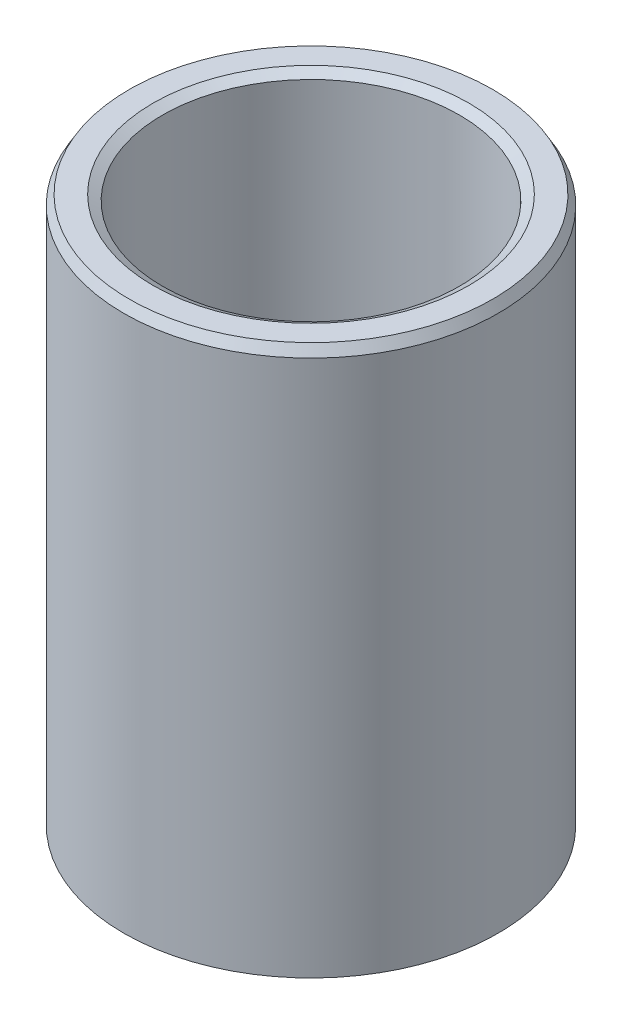
ISO-10303-21;
HEADER;
FILE_DESCRIPTION(('STEP AP214'),'2;1');
FILE_NAME('part.step','',(''),(''),'','','');
FILE_SCHEMA(('AUTOMOTIVE_DESIGN { 1 0 10303 214 1 1 1 1 }'));
ENDSEC;
DATA;
#1=APPLICATION_CONTEXT('core data for automotive mechanical design processes');
#2=APPLICATION_PROTOCOL_DEFINITION('international standard','automotive_design',2000,#1);
#3=PRODUCT_CONTEXT('',#1,'mechanical');
#4=PRODUCT('Part','Part','',(#3));
#5=PRODUCT_RELATED_PRODUCT_CATEGORY('part','',(#4));
#6=PRODUCT_DEFINITION_FORMATION('','',#4);
#7=PRODUCT_DEFINITION_CONTEXT('part definition',#1,'design');
#8=PRODUCT_DEFINITION('design','',#6,#7);
#9=PRODUCT_DEFINITION_SHAPE('','',#8);
#10=(LENGTH_UNIT() NAMED_UNIT(*) SI_UNIT(.MILLI.,.METRE.));
#11=(NAMED_UNIT(*) PLANE_ANGLE_UNIT() SI_UNIT($,.RADIAN.));
#12=(NAMED_UNIT(*) SI_UNIT($,.STERADIAN.) SOLID_ANGLE_UNIT());
#13=UNCERTAINTY_MEASURE_WITH_UNIT(LENGTH_MEASURE(1.E-05),#10,'distance_accuracy_value','');
#14=(GEOMETRIC_REPRESENTATION_CONTEXT(3) GLOBAL_UNCERTAINTY_ASSIGNED_CONTEXT((#13)) GLOBAL_UNIT_ASSIGNED_CONTEXT((#10,
#11,#12)) REPRESENTATION_CONTEXT('',''));
#15=CARTESIAN_POINT('',(0.,0.,0.));
#16=DIRECTION('',(0.,0.,1.));
#17=DIRECTION('',(1.,0.,0.));
#18=AXIS2_PLACEMENT_3D('',#15,#16,#17);
#19=CARTESIAN_POINT('',(0.,81.067047695199,0.));
#20=DIRECTION('',(0.,-1.,0.));
#21=DIRECTION('',(0.,0.,-1.));
#22=AXIS2_PLACEMENT_3D('',#19,#20,#21);
#23=CYLINDRICAL_SURFACE('',#22,27.5);
#24=CARTESIAN_POINT('',(0.,0.808685771709672,0.));
#25=DIRECTION('',(0.,1.,0.));
#26=DIRECTION('',(0.,0.,1.));
#27=AXIS2_PLACEMENT_3D('',#24,#25,#26);
#28=CIRCLE('',#27,27.5);
#29=CARTESIAN_POINT('',(0.,0.808685771709658,-27.5));
#30=VERTEX_POINT('',#29);
#31=EDGE_CURVE('E10',#30,#30,#28,.T.);
#32=CARTESIAN_POINT('',(0.,79.6663628512399,0.));
#33=DIRECTION('',(0.,1.,0.));
#34=DIRECTION('',(0.,0.,1.));
#35=AXIS2_PLACEMENT_3D('',#32,#33,#34);
#36=CIRCLE('',#35,27.5);
#37=CARTESIAN_POINT('',(0.,79.6663628512399,-27.5));
#38=VERTEX_POINT('',#37);
#39=EDGE_CURVE('E50',#38,#38,#36,.F.);
#40=CARTESIAN_POINT('',(0.,0.808685771709658,-27.5));
#41=CARTESIAN_POINT('',(0.,1.63011990795477,-27.5));
#42=CARTESIAN_POINT('',(0.,2.45155404419987,-27.5));
#43=CARTESIAN_POINT('',(0.,4.09442231669009,-27.5));
#44=CARTESIAN_POINT('',(0.,4.91585645293519,-27.5));
#45=CARTESIAN_POINT('',(0.,6.5587247254254,-27.5));
#46=CARTESIAN_POINT('',(0.,7.38015886167051,-27.5));
#47=CARTESIAN_POINT('',(0.,9.02302713416073,-27.5));
#48=CARTESIAN_POINT('',(0.,9.84446127040584,-27.5));
#49=CARTESIAN_POINT('',(0.,11.487329542896,-27.5));
#50=CARTESIAN_POINT('',(0.,12.3087636791412,-27.5));
#51=CARTESIAN_POINT('',(0.,13.9516319516314,-27.5));
#52=CARTESIAN_POINT('',(0.,14.7730660878765,-27.5));
#53=CARTESIAN_POINT('',(0.,16.4159343603667,-27.5));
#54=CARTESIAN_POINT('',(0.,17.2373684966118,-27.5));
#55=CARTESIAN_POINT('',(0.,18.880236769102,-27.5));
#56=CARTESIAN_POINT('',(0.,19.7016709053471,-27.5));
#57=CARTESIAN_POINT('',(0.,21.3445391778373,-27.5));
#58=CARTESIAN_POINT('',(0.,22.1659733140824,-27.5));
#59=CARTESIAN_POINT('',(0.,23.8088415865726,-27.5));
#60=CARTESIAN_POINT('',(0.,24.6302757228177,-27.5));
#61=CARTESIAN_POINT('',(0.,26.273143995308,-27.5));
#62=CARTESIAN_POINT('',(0.,27.0945781315531,-27.5));
#63=CARTESIAN_POINT('',(0.,28.7374464040433,-27.5));
#64=CARTESIAN_POINT('',(0.,29.5588805402884,-27.5));
#65=CARTESIAN_POINT('',(0.,31.2017488127786,-27.5));
#66=CARTESIAN_POINT('',(0.,32.0231829490237,-27.5));
#67=CARTESIAN_POINT('',(0.,33.6660512215139,-27.5));
#68=CARTESIAN_POINT('',(0.,34.487485357759,-27.5));
#69=CARTESIAN_POINT('',(0.,36.1303536302492,-27.5));
#70=CARTESIAN_POINT('',(0.,36.9517877664943,-27.5));
#71=CARTESIAN_POINT('',(0.,38.5946560389846,-27.5));
#72=CARTESIAN_POINT('',(0.,39.4160901752297,-27.5));
#73=CARTESIAN_POINT('',(0.,41.0589584477199,-27.5));
#74=CARTESIAN_POINT('',(0.,41.880392583965,-27.5));
#75=CARTESIAN_POINT('',(0.,43.5232608564552,-27.5));
#76=CARTESIAN_POINT('',(0.,44.3446949927003,-27.5));
#77=CARTESIAN_POINT('',(0.,45.9875632651905,-27.5));
#78=CARTESIAN_POINT('',(0.,46.8089974014356,-27.5));
#79=CARTESIAN_POINT('',(0.,48.4518656739258,-27.5));
#80=CARTESIAN_POINT('',(0.,49.2732998101709,-27.5));
#81=CARTESIAN_POINT('',(0.,50.9161680826612,-27.5));
#82=CARTESIAN_POINT('',(0.,51.7376022189063,-27.5));
#83=CARTESIAN_POINT('',(0.,53.3804704913965,-27.5));
#84=CARTESIAN_POINT('',(0.,54.2019046276416,-27.5));
#85=CARTESIAN_POINT('',(0.,55.8447729001318,-27.5));
#86=CARTESIAN_POINT('',(0.,56.6662070363769,-27.5));
#87=CARTESIAN_POINT('',(0.,58.3090753088671,-27.5));
#88=CARTESIAN_POINT('',(0.,59.1305094451122,-27.5));
#89=CARTESIAN_POINT('',(0.,60.7733777176024,-27.5));
#90=CARTESIAN_POINT('',(0.,61.5948118538475,-27.5));
#91=CARTESIAN_POINT('',(0.,63.2376801263378,-27.5));
#92=CARTESIAN_POINT('',(0.,64.0591142625829,-27.5));
#93=CARTESIAN_POINT('',(0.,65.7019825350731,-27.5));
#94=CARTESIAN_POINT('',(0.,66.5234166713182,-27.5));
#95=CARTESIAN_POINT('',(0.,68.1662849438084,-27.5));
#96=CARTESIAN_POINT('',(0.,68.9877190800535,-27.5));
#97=CARTESIAN_POINT('',(0.,70.6305873525437,-27.5));
#98=CARTESIAN_POINT('',(0.,71.4520214887888,-27.5));
#99=CARTESIAN_POINT('',(0.,73.094889761279,-27.5));
#100=CARTESIAN_POINT('',(0.,73.9163238975242,-27.5));
#101=CARTESIAN_POINT('',(0.,75.5591921700144,-27.5));
#102=CARTESIAN_POINT('',(0.,76.3806263062595,-27.5));
#103=CARTESIAN_POINT('',(0.,78.0234945787497,-27.5));
#104=CARTESIAN_POINT('',(0.,78.8449287149948,-27.5));
#105=CARTESIAN_POINT('',(0.,79.6663628512399,-27.5));
#106=B_SPLINE_CURVE_WITH_KNOTS('',3,(#40,#41,#42,#43,#44,#45,#46,#47,#48,#49,#50,#51,#52,#53,
#54,#55,#56,#57,#58,#59,#60,#61,#62,#63,#64,#65,#66,#67,#68,#69,#70,#71,#72,#73,#74,#75,#76,#77,
#78,#79,#80,#81,#82,#83,#84,#85,#86,#87,#88,#89,#90,#91,#92,#93,#94,#95,#96,#97,#98,#99,#100,
#101,#102,#103,#104,#105),.UNSPECIFIED.,.F.,.F.,(4,2,2,2,2,2,2,2,2,2,2,2,2,2,2,2,2,2,2,2,2,2,2,
2,2,2,2,2,2,2,2,2,4),(0.,2.46430240873532,4.92860481747064,7.39290722620596,9.85720963494129,
12.3215120436766,14.7858144524119,17.2501168611472,19.7144192698826,22.1787216786179,
24.6430240873532,27.1073264960885,29.5716289048238,32.0359313135592,34.5002337222945,
36.9645361310298,39.4288385397651,41.8931409485004,44.3574433572358,46.8217457659711,
49.2860481747064,51.7503505834417,54.214652992177,56.6789554009124,59.1432578096477,
61.607560218383,64.0718626271183,66.5361650358536,69.0004674445889,71.4647698533243,
73.9290722620596,76.3933746707949,78.8576770795302),.UNSPECIFIED.);
#107=EDGE_CURVE('BSEAM39',#30,#38,#106,.T.);
#108=ORIENTED_EDGE('',*,*,#31,.T.);
#109=ORIENTED_EDGE('',*,*,#39,.T.);
#110=ORIENTED_EDGE('',*,*,#107,.T.);
#111=ORIENTED_EDGE('',*,*,#107,.F.);
#112=EDGE_LOOP('',(#108,#110,#109,#111));
#113=FACE_BOUND('',#112,.T.);
#114=ADVANCED_FACE('F39',(#113),#23,.T.);
#115=CARTESIAN_POINT('',(0.,81.067047695199,0.));
#116=DIRECTION('',(0.,1.,0.));
#117=DIRECTION('',(0.,0.,1.));
#118=AXIS2_PLACEMENT_3D('',#115,#116,#117);
#119=PLANE('',#118);
#120=CARTESIAN_POINT('',(0.,81.067047695199,0.));
#121=DIRECTION('',(0.,1.,0.));
#122=DIRECTION('',(0.,0.,1.));
#123=AXIS2_PLACEMENT_3D('',#120,#121,#122);
#124=CIRCLE('',#123,23.2023040256056);
#125=CARTESIAN_POINT('',(0.,81.067047695199,23.2023040256056));
#126=VERTEX_POINT('',#125);
#127=EDGE_CURVE('E58',#126,#126,#124,.F.);
#128=ORIENTED_EDGE('',*,*,#127,.T.);
#129=EDGE_LOOP('',(#128));
#130=FACE_BOUND('',#129,.T.);
#131=CARTESIAN_POINT('',(0.,81.067047695199,0.));
#132=DIRECTION('',(0.,1.,0.));
#133=DIRECTION('',(0.,0.,1.));
#134=AXIS2_PLACEMENT_3D('',#131,#132,#133);
#135=CIRCLE('',#134,26.6913142282904);
#136=CARTESIAN_POINT('',(0.,81.067047695199,-26.6913142282904));
#137=VERTEX_POINT('',#136);
#138=EDGE_CURVE('E61',#137,#137,#135,.T.);
#139=ORIENTED_EDGE('',*,*,#138,.T.);
#140=EDGE_LOOP('',(#139));
#141=FACE_BOUND('',#140,.T.);
#142=ADVANCED_FACE('F88',(#130,#141),#119,.T.);
#143=CARTESIAN_POINT('',(0.,0.,0.));
#144=DIRECTION('',(0.,1.,0.));
#145=DIRECTION('',(0.,0.,1.));
#146=AXIS2_PLACEMENT_3D('',#143,#144,#145);
#147=PLANE('',#146);
#148=CARTESIAN_POINT('',(0.,0.,0.));
#149=DIRECTION('',(0.,1.,0.));
#150=DIRECTION('',(0.,0.,1.));
#151=AXIS2_PLACEMENT_3D('',#148,#149,#150);
#152=CIRCLE('',#151,22.610304953356);
#153=CARTESIAN_POINT('',(0.,0.,22.610304953356));
#154=VERTEX_POINT('',#153);
#155=EDGE_CURVE('E51',#154,#154,#152,.T.);
#156=ORIENTED_EDGE('',*,*,#155,.T.);
#157=EDGE_LOOP('',(#156));
#158=FACE_BOUND('',#157,.T.);
#159=CARTESIAN_POINT('',(0.,0.,0.));
#160=DIRECTION('',(0.,1.,0.));
#161=DIRECTION('',(0.,0.,1.));
#162=AXIS2_PLACEMENT_3D('',#159,#160,#161);
#163=CIRCLE('',#162,26.0993151560408);
#164=CARTESIAN_POINT('',(0.,0.,26.0993151560408));
#165=VERTEX_POINT('',#164);
#166=EDGE_CURVE('E54',#165,#165,#163,.F.);
#167=ORIENTED_EDGE('',*,*,#166,.T.);
#168=EDGE_LOOP('',(#167));
#169=FACE_BOUND('',#168,.T.);
#170=ADVANCED_FACE('F83',(#158,#169),#147,.F.);
#171=CARTESIAN_POINT('',(0.,81.067047695199,0.));
#172=DIRECTION('',(0.,-1.,0.));
#173=DIRECTION('',(0.,0.,-1.));
#174=AXIS2_PLACEMENT_3D('',#171,#172,#173);
#175=CYLINDRICAL_SURFACE('',#174,21.8016191816464);
#176=CARTESIAN_POINT('',(0.,80.2583619234893,0.));
#177=DIRECTION('',(0.,1.,0.));
#178=DIRECTION('',(0.,0.,1.));
#179=AXIS2_PLACEMENT_3D('',#176,#177,#178);
#180=CIRCLE('',#179,21.8016191816464);
#181=CARTESIAN_POINT('',(0.,80.2583619234893,-21.8016191816464));
#182=VERTEX_POINT('',#181);
#183=EDGE_CURVE('E67',#182,#182,#180,.T.);
#184=CARTESIAN_POINT('',(0.,1.40068484395911,0.));
#185=DIRECTION('',(0.,1.,0.));
#186=DIRECTION('',(0.,0.,1.));
#187=AXIS2_PLACEMENT_3D('',#184,#185,#186);
#188=CIRCLE('',#187,21.8016191816464);
#189=CARTESIAN_POINT('',(0.,1.4006848439591,-21.8016191816464));
#190=VERTEX_POINT('',#189);
#191=EDGE_CURVE('E69',#190,#190,#188,.F.);
#192=CARTESIAN_POINT('',(0.,80.2583619234893,-21.8016191816464));
#193=CARTESIAN_POINT('',(0.,79.4369277872442,-21.8016191816464));
#194=CARTESIAN_POINT('',(0.,78.6154936509991,-21.8016191816464));
#195=CARTESIAN_POINT('',(0.,76.9726253785089,-21.8016191816464));
#196=CARTESIAN_POINT('',(0.,76.1511912422638,-21.8016191816464));
#197=CARTESIAN_POINT('',(0.,74.5083229697735,-21.8016191816464));
#198=CARTESIAN_POINT('',(0.,73.6868888335284,-21.8016191816464));
#199=CARTESIAN_POINT('',(0.,72.0440205610382,-21.8016191816464));
#200=CARTESIAN_POINT('',(0.,71.2225864247931,-21.8016191816464));
#201=CARTESIAN_POINT('',(0.,69.5797181523029,-21.8016191816464));
#202=CARTESIAN_POINT('',(0.,68.7582840160578,-21.8016191816464));
#203=CARTESIAN_POINT('',(0.,67.1154157435676,-21.8016191816464));
#204=CARTESIAN_POINT('',(0.,66.2939816073225,-21.8016191816464));
#205=CARTESIAN_POINT('',(0.,64.6511133348323,-21.8016191816464));
#206=CARTESIAN_POINT('',(0.,63.8296791985872,-21.8016191816464));
#207=CARTESIAN_POINT('',(0.,62.186810926097,-21.8016191816464));
#208=CARTESIAN_POINT('',(0.,61.3653767898519,-21.8016191816464));
#209=CARTESIAN_POINT('',(0.,59.7225085173616,-21.8016191816464));
#210=CARTESIAN_POINT('',(0.,58.9010743811165,-21.8016191816464));
#211=CARTESIAN_POINT('',(0.,57.2582061086263,-21.8016191816464));
#212=CARTESIAN_POINT('',(0.,56.4367719723812,-21.8016191816464));
#213=CARTESIAN_POINT('',(0.,54.793903699891,-21.8016191816464));
#214=CARTESIAN_POINT('',(0.,53.9724695636459,-21.8016191816464));
#215=CARTESIAN_POINT('',(0.,52.3296012911557,-21.8016191816464));
#216=CARTESIAN_POINT('',(0.,51.5081671549106,-21.8016191816464));
#217=CARTESIAN_POINT('',(0.,49.8652988824204,-21.8016191816464));
#218=CARTESIAN_POINT('',(0.,49.0438647461753,-21.8016191816464));
#219=CARTESIAN_POINT('',(0.,47.400996473685,-21.8016191816464));
#220=CARTESIAN_POINT('',(0.,46.5795623374399,-21.8016191816464));
#221=CARTESIAN_POINT('',(0.,44.9366940649497,-21.8016191816464));
#222=CARTESIAN_POINT('',(0.,44.1152599287046,-21.8016191816464));
#223=CARTESIAN_POINT('',(0.,42.4723916562144,-21.8016191816464));
#224=CARTESIAN_POINT('',(0.,41.6509575199693,-21.8016191816464));
#225=CARTESIAN_POINT('',(0.,40.0080892474791,-21.8016191816464));
#226=CARTESIAN_POINT('',(0.,39.186655111234,-21.8016191816464));
#227=CARTESIAN_POINT('',(0.,37.5437868387438,-21.8016191816464));
#228=CARTESIAN_POINT('',(0.,36.7223527024987,-21.8016191816464));
#229=CARTESIAN_POINT('',(0.,35.0794844300085,-21.8016191816464));
#230=CARTESIAN_POINT('',(0.,34.2580502937634,-21.8016191816464));
#231=CARTESIAN_POINT('',(0.,32.6151820212731,-21.8016191816464));
#232=CARTESIAN_POINT('',(0.,31.793747885028,-21.8016191816464));
#233=CARTESIAN_POINT('',(0.,30.1508796125378,-21.8016191816464));
#234=CARTESIAN_POINT('',(0.,29.3294454762927,-21.8016191816464));
#235=CARTESIAN_POINT('',(0.,27.6865772038025,-21.8016191816464));
#236=CARTESIAN_POINT('',(0.,26.8651430675574,-21.8016191816464));
#237=CARTESIAN_POINT('',(0.,25.2222747950672,-21.8016191816464));
#238=CARTESIAN_POINT('',(0.,24.4008406588221,-21.8016191816464));
#239=CARTESIAN_POINT('',(0.,22.7579723863319,-21.8016191816464));
#240=CARTESIAN_POINT('',(0.,21.9365382500868,-21.8016191816464));
#241=CARTESIAN_POINT('',(0.,20.2936699775965,-21.8016191816464));
#242=CARTESIAN_POINT('',(0.,19.4722358413514,-21.8016191816464));
#243=CARTESIAN_POINT('',(0.,17.8293675688612,-21.8016191816464));
#244=CARTESIAN_POINT('',(0.,17.0079334326161,-21.8016191816464));
#245=CARTESIAN_POINT('',(0.,15.3650651601259,-21.8016191816464));
#246=CARTESIAN_POINT('',(0.,14.5436310238808,-21.8016191816464));
#247=CARTESIAN_POINT('',(0.,12.9007627513906,-21.8016191816464));
#248=CARTESIAN_POINT('',(0.,12.0793286151455,-21.8016191816464));
#249=CARTESIAN_POINT('',(0.,10.4364603426553,-21.8016191816464));
#250=CARTESIAN_POINT('',(0.,9.61502620641017,-21.8016191816464));
#251=CARTESIAN_POINT('',(0.,7.97215793391996,-21.8016191816464));
#252=CARTESIAN_POINT('',(0.,7.15072379767485,-21.8016191816464));
#253=CARTESIAN_POINT('',(0.,5.50785552518464,-21.8016191816464));
#254=CARTESIAN_POINT('',(0.,4.68642138893953,-21.8016191816464));
#255=CARTESIAN_POINT('',(0.,3.04355311644931,-21.8016191816464));
#256=CARTESIAN_POINT('',(0.,2.2221189802042,-21.8016191816464));
#257=CARTESIAN_POINT('',(0.,1.4006848439591,-21.8016191816464));
#258=B_SPLINE_CURVE_WITH_KNOTS('',3,(#192,#193,#194,#195,#196,#197,#198,#199,#200,#201,#202,
#203,#204,#205,#206,#207,#208,#209,#210,#211,#212,#213,#214,#215,#216,#217,#218,#219,#220,#221,
#222,#223,#224,#225,#226,#227,#228,#229,#230,#231,#232,#233,#234,#235,#236,#237,#238,#239,#240,
#241,#242,#243,#244,#245,#246,#247,#248,#249,#250,#251,#252,#253,#254,#255,#256,#257),
.UNSPECIFIED.,.F.,.F.,(4,2,2,2,2,2,2,2,2,2,2,2,2,2,2,2,2,2,2,2,2,2,2,2,2,2,2,2,2,2,2,2,4),(0.,
2.46430240873532,4.92860481747065,7.39290722620596,9.85720963494129,12.3215120436766,
14.7858144524119,17.2501168611472,19.7144192698826,22.1787216786179,24.6430240873532,
27.1073264960885,29.5716289048238,32.0359313135591,34.5002337222945,36.9645361310298,
39.4288385397651,41.8931409485004,44.3574433572357,46.8217457659711,49.2860481747064,
51.7503505834417,54.214652992177,56.6789554009123,59.1432578096477,61.607560218383,
64.0718626271183,66.5361650358536,69.0004674445889,71.4647698533242,73.9290722620595,
76.3933746707949,78.8576770795302),.UNSPECIFIED.);
#259=EDGE_CURVE('BSEAM71',#182,#190,#258,.T.);
#260=ORIENTED_EDGE('',*,*,#183,.T.);
#261=ORIENTED_EDGE('',*,*,#191,.T.);
#262=ORIENTED_EDGE('',*,*,#259,.T.);
#263=ORIENTED_EDGE('',*,*,#259,.F.);
#264=EDGE_LOOP('',(#260,#262,#261,#263));
#265=FACE_BOUND('',#264,.T.);
#266=ADVANCED_FACE('F71',(#265),#175,.F.);
#267=CARTESIAN_POINT('',(0.,80.2583619234893,0.));
#268=DIRECTION('',(0.,1.,0.));
#269=DIRECTION('',(0.,0.,1.));
#270=AXIS2_PLACEMENT_3D('',#267,#268,#269);
#271=CONICAL_SURFACE('',#270,21.8016191816464,1.0471975511966);
#272=ORIENTED_EDGE('',*,*,#127,.F.);
#273=EDGE_LOOP('',(#272));
#274=FACE_BOUND('',#273,.T.);
#275=ORIENTED_EDGE('',*,*,#183,.F.);
#276=EDGE_LOOP('',(#275));
#277=FACE_BOUND('',#276,.T.);
#278=ADVANCED_FACE('F77',(#274,#277),#271,.F.);
#279=CARTESIAN_POINT('',(0.,0.,0.));
#280=DIRECTION('',(0.,-1.,0.));
#281=DIRECTION('',(0.,0.,-1.));
#282=AXIS2_PLACEMENT_3D('',#279,#280,#281);
#283=CONICAL_SURFACE('',#282,22.610304953356,0.523598775598291);
#284=ORIENTED_EDGE('',*,*,#191,.F.);
#285=EDGE_LOOP('',(#284));
#286=FACE_BOUND('',#285,.T.);
#287=ORIENTED_EDGE('',*,*,#155,.F.);
#288=EDGE_LOOP('',(#287));
#289=FACE_BOUND('',#288,.T.);
#290=ADVANCED_FACE('F73',(#286,#289),#283,.F.);
#291=CARTESIAN_POINT('',(0.,0.808685771709672,0.));
#292=DIRECTION('',(0.,1.,0.));
#293=DIRECTION('',(0.,0.,1.));
#294=AXIS2_PLACEMENT_3D('',#291,#292,#293);
#295=CONICAL_SURFACE('',#294,27.5,1.0471975511966);
#296=ORIENTED_EDGE('',*,*,#166,.F.);
#297=EDGE_LOOP('',(#296));
#298=FACE_BOUND('',#297,.T.);
#299=ORIENTED_EDGE('',*,*,#31,.F.);
#300=EDGE_LOOP('',(#299));
#301=FACE_BOUND('',#300,.T.);
#302=ADVANCED_FACE('F76',(#298,#301),#295,.T.);
#303=CARTESIAN_POINT('',(0.,81.067047695199,0.));
#304=DIRECTION('',(0.,-1.,0.));
#305=DIRECTION('',(0.,0.,-1.));
#306=AXIS2_PLACEMENT_3D('',#303,#304,#305);
#307=CONICAL_SURFACE('',#306,26.6913142282904,0.523598775598302);
#308=CARTESIAN_POINT('',(0.,79.6663628512399,-27.5));
#309=CARTESIAN_POINT('',(0.,79.6809533183645,-27.491576189878));
#310=CARTESIAN_POINT('',(0.,79.695543785489,-27.4831523797561));
#311=CARTESIAN_POINT('',(0.,79.7247247197382,-27.4663047595121));
#312=CARTESIAN_POINT('',(0.,79.7393151868628,-27.4578809493901));
#313=CARTESIAN_POINT('',(0.,79.7684961211119,-27.4410333291462));
#314=CARTESIAN_POINT('',(0.,79.7830865882365,-27.4326095190242));
#315=CARTESIAN_POINT('',(0.,79.8122675224856,-27.4157618987803));
#316=CARTESIAN_POINT('',(0.,79.8268579896102,-27.4073380886583));
#317=CARTESIAN_POINT('',(0.,79.8560389238593,-27.3904904684143));
#318=CARTESIAN_POINT('',(0.,79.8706293909839,-27.3820666582924));
#319=CARTESIAN_POINT('',(0.,79.8998103252331,-27.3652190380484));
#320=CARTESIAN_POINT('',(0.,79.9144007923577,-27.3567952279264));
#321=CARTESIAN_POINT('',(0.,79.9435817266068,-27.3399476076825));
#322=CARTESIAN_POINT('',(0.,79.9581721937314,-27.3315237975605));
#323=CARTESIAN_POINT('',(0.,79.9873531279805,-27.3146761773166));
#324=CARTESIAN_POINT('',(0.,80.0019435951051,-27.3062523671946));
#325=CARTESIAN_POINT('',(0.,80.0311245293542,-27.2894047469506));
#326=CARTESIAN_POINT('',(0.,80.0457149964788,-27.2809809368287));
#327=CARTESIAN_POINT('',(0.,80.0748959307279,-27.2641333165847));
#328=CARTESIAN_POINT('',(0.,80.0894863978525,-27.2557095064627));
#329=CARTESIAN_POINT('',(0.,80.1186673321017,-27.2388618862188));
#330=CARTESIAN_POINT('',(0.,80.1332577992263,-27.2304380760968));
#331=CARTESIAN_POINT('',(0.,80.1624387334754,-27.2135904558529));
#332=CARTESIAN_POINT('',(0.,80.1770292006,-27.2051666457309));
#333=CARTESIAN_POINT('',(0.,80.2062101348491,-27.1883190254869));
#334=CARTESIAN_POINT('',(0.,80.2208006019737,-27.179895215365));
#335=CARTESIAN_POINT('',(0.,80.2499815362228,-27.163047595121));
#336=CARTESIAN_POINT('',(0.,80.2645720033474,-27.154623784999));
#337=CARTESIAN_POINT('',(0.,80.2937529375966,-27.1377761647551));
#338=CARTESIAN_POINT('',(0.,80.3083434047211,-27.1293523546331));
#339=CARTESIAN_POINT('',(0.,80.3375243389703,-27.1125047343892));
#340=CARTESIAN_POINT('',(0.,80.3521148060948,-27.1040809242672));
#341=CARTESIAN_POINT('',(0.,80.381295740344,-27.0872333040232));
#342=CARTESIAN_POINT('',(0.,80.3958862074686,-27.0788094939013));
#343=CARTESIAN_POINT('',(0.,80.4250671417177,-27.0619618736573));
#344=CARTESIAN_POINT('',(0.,80.4396576088423,-27.0535380635353));
#345=CARTESIAN_POINT('',(0.,80.4688385430914,-27.0366904432914));
#346=CARTESIAN_POINT('',(0.,80.483429010216,-27.0282666331694));
#347=CARTESIAN_POINT('',(0.,80.5126099444652,-27.0114190129255));
#348=CARTESIAN_POINT('',(0.,80.5272004115897,-27.0029952028035));
#349=CARTESIAN_POINT('',(0.,80.5563813458389,-26.9861475825595));
#350=CARTESIAN_POINT('',(0.,80.5709718129634,-26.9777237724376));
#351=CARTESIAN_POINT('',(0.,80.6001527472126,-26.9608761521936));
#352=CARTESIAN_POINT('',(0.,80.6147432143372,-26.9524523420716));
#353=CARTESIAN_POINT('',(0.,80.6439241485863,-26.9356047218277));
#354=CARTESIAN_POINT('',(0.,80.6585146157109,-26.9271809117057));
#355=CARTESIAN_POINT('',(0.,80.68769554996,-26.9103332914618));
#356=CARTESIAN_POINT('',(0.,80.7022860170846,-26.9019094813398));
#357=CARTESIAN_POINT('',(0.,80.7314669513338,-26.8850618610958));
#358=CARTESIAN_POINT('',(0.,80.7460574184583,-26.8766380509739));
#359=CARTESIAN_POINT('',(0.,80.7752383527075,-26.8597904307299));
#360=CARTESIAN_POINT('',(0.,80.7898288198321,-26.8513666206079));
#361=CARTESIAN_POINT('',(0.,80.8190097540812,-26.834519000364));
#362=CARTESIAN_POINT('',(0.,80.8336002212058,-26.826095190242));
#363=CARTESIAN_POINT('',(0.,80.8627811554549,-26.8092475699981));
#364=CARTESIAN_POINT('',(0.,80.8773716225795,-26.8008237598761));
#365=CARTESIAN_POINT('',(0.,80.9065525568286,-26.7839761396321));
#366=CARTESIAN_POINT('',(0.,80.9211430239532,-26.7755523295102));
#367=CARTESIAN_POINT('',(0.,80.9503239582024,-26.7587047092662));
#368=CARTESIAN_POINT('',(0.,80.9649144253269,-26.7502808991442));
#369=CARTESIAN_POINT('',(0.,80.9940953595761,-26.7334332789003));
#370=CARTESIAN_POINT('',(0.,81.0086858267007,-26.7250094687783));
#371=CARTESIAN_POINT('',(0.,81.0378667609498,-26.7081618485344));
#372=CARTESIAN_POINT('',(0.,81.0524572280744,-26.6997380384124));
#373=CARTESIAN_POINT('',(0.,81.067047695199,-26.6913142282904));
#374=B_SPLINE_CURVE_WITH_KNOTS('',3,(#308,#309,#310,#311,#312,#313,#314,#315,#316,#317,#318,
#319,#320,#321,#322,#323,#324,#325,#326,#327,#328,#329,#330,#331,#332,#333,#334,#335,#336,#337,
#338,#339,#340,#341,#342,#343,#344,#345,#346,#347,#348,#349,#350,#351,#352,#353,#354,#355,#356,
#357,#358,#359,#360,#361,#362,#363,#364,#365,#366,#367,#368,#369,#370,#371,#372,#373),
.UNSPECIFIED.,.F.,.F.,(4,2,2,2,2,2,2,2,2,2,2,2,2,2,2,2,2,2,2,2,2,2,2,2,2,2,2,2,2,2,2,2,4),(0.,
0.0505428607318519,0.101085721463704,0.151628582195557,0.202171442927397,0.252714303659249,
0.303257164391103,0.353800025122955,0.404342885854794,0.454885746586648,0.5054286073185,
0.555971468050352,0.606514328782193,0.657057189514045,0.707600050245897,0.758142910977749,
0.808685771709591,0.859228632441443,0.909771493173295,0.960314353905148,1.01085721463699,
1.06140007536884,1.11194293610069,1.16248579683255,1.2130286575644,1.26357151829624,
1.31411437902809,1.36465723975994,1.4152001004918,1.46574296122364,1.51628582195549,
1.56682868268734,1.61737154341919),.UNSPECIFIED.);
#375=EDGE_CURVE('BSEAM45',#38,#137,#374,.T.);
#376=ORIENTED_EDGE('',*,*,#39,.F.);
#377=ORIENTED_EDGE('',*,*,#138,.F.);
#378=ORIENTED_EDGE('',*,*,#375,.T.);
#379=ORIENTED_EDGE('',*,*,#375,.F.);
#380=EDGE_LOOP('',(#376,#378,#377,#379));
#381=FACE_BOUND('',#380,.T.);
#382=ADVANCED_FACE('F45',(#381),#307,.T.);
#383=CLOSED_SHELL('',(#114,#142,#170,#266,#278,#290,#302,#382));
#384=MANIFOLD_SOLID_BREP('B2',#383);
#385=ADVANCED_BREP_SHAPE_REPRESENTATION('',(#18,#384),#14);
#386=SHAPE_DEFINITION_REPRESENTATION(#9,#385);
ENDSEC;
END-ISO-10303-21;
